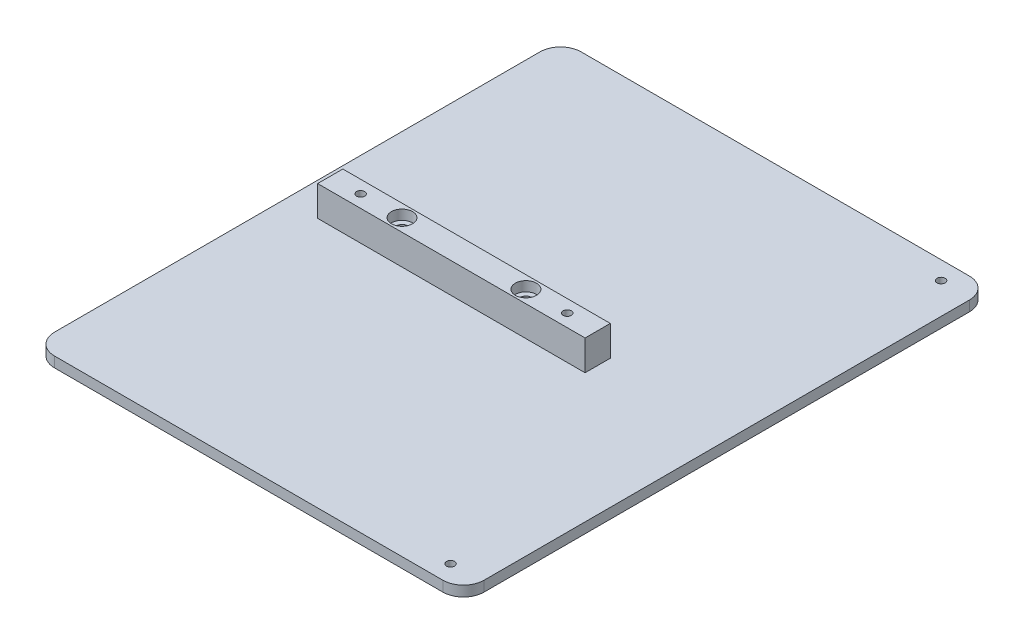
ISO-10303-21;
HEADER;
FILE_DESCRIPTION(('STEP AP214'),'2;1');
FILE_NAME('part.step','',(''),(''),'','','');
FILE_SCHEMA(('AUTOMOTIVE_DESIGN { 1 0 10303 214 1 1 1 1 }'));
ENDSEC;
DATA;
#1=APPLICATION_CONTEXT('core data for automotive mechanical design processes');
#2=APPLICATION_PROTOCOL_DEFINITION('international standard','automotive_design',2000,#1);
#3=PRODUCT_CONTEXT('',#1,'mechanical');
#4=PRODUCT('Part','Part','',(#3));
#5=PRODUCT_RELATED_PRODUCT_CATEGORY('part','',(#4));
#6=PRODUCT_DEFINITION_FORMATION('','',#4);
#7=PRODUCT_DEFINITION_CONTEXT('part definition',#1,'design');
#8=PRODUCT_DEFINITION('design','',#6,#7);
#9=PRODUCT_DEFINITION_SHAPE('','',#8);
#10=(LENGTH_UNIT() NAMED_UNIT(*) SI_UNIT(.MILLI.,.METRE.));
#11=(NAMED_UNIT(*) PLANE_ANGLE_UNIT() SI_UNIT($,.RADIAN.));
#12=(NAMED_UNIT(*) SI_UNIT($,.STERADIAN.) SOLID_ANGLE_UNIT());
#13=UNCERTAINTY_MEASURE_WITH_UNIT(LENGTH_MEASURE(1.E-05),#10,'distance_accuracy_value','');
#14=(GEOMETRIC_REPRESENTATION_CONTEXT(3) GLOBAL_UNCERTAINTY_ASSIGNED_CONTEXT((#13)) GLOBAL_UNIT_ASSIGNED_CONTEXT((#10,
#11,#12)) REPRESENTATION_CONTEXT('',''));
#15=CARTESIAN_POINT('',(0.,0.,0.));
#16=DIRECTION('',(0.,0.,1.));
#17=DIRECTION('',(1.,0.,0.));
#18=AXIS2_PLACEMENT_3D('',#15,#16,#17);
#19=CARTESIAN_POINT('',(0.,3.175,0.));
#20=DIRECTION('',(0.,1.,0.));
#21=DIRECTION('',(0.,0.,1.));
#22=AXIS2_PLACEMENT_3D('',#19,#20,#21);
#23=PLANE('',#22);
#24=CARTESIAN_POINT('',(56.5150000000001,3.175,75.40625));
#25=DIRECTION('',(0.,1.,0.));
#26=DIRECTION('',(0.,0.,1.));
#27=AXIS2_PLACEMENT_3D('',#24,#25,#26);
#28=CIRCLE('',#27,1.25);
#29=CARTESIAN_POINT('',(56.5150000000001,3.175,76.65625));
#30=VERTEX_POINT('',#29);
#31=EDGE_CURVE('E148',#30,#30,#28,.T.);
#32=ORIENTED_EDGE('',*,*,#31,.F.);
#33=EDGE_LOOP('',(#32));
#34=FACE_BOUND('',#33,.T.);
#35=CARTESIAN_POINT('',(56.515,3.175,-75.40625));
#36=DIRECTION('',(0.,1.,0.));
#37=DIRECTION('',(0.,0.,1.));
#38=AXIS2_PLACEMENT_3D('',#35,#36,#37);
#39=CIRCLE('',#38,1.25);
#40=CARTESIAN_POINT('',(56.515,3.175,-74.15625));
#41=VERTEX_POINT('',#40);
#42=EDGE_CURVE('E158',#41,#41,#39,.T.);
#43=ORIENTED_EDGE('',*,*,#42,.F.);
#44=EDGE_LOOP('',(#43));
#45=FACE_BOUND('',#44,.T.);
#46=DIRECTION('',(-1.,0.,0.));
#47=VECTOR('',#46,1.);
#48=CARTESIAN_POINT('',(66.04,3.175,-80.9625));
#49=LINE('',#48,#47);
#50=CARTESIAN_POINT('',(59.69,3.175,-80.9625));
#51=VERTEX_POINT('',#50);
#52=CARTESIAN_POINT('',(-59.69,3.175,-80.9625));
#53=VERTEX_POINT('',#52);
#54=EDGE_CURVE('E174',#51,#53,#49,.T.);
#55=ORIENTED_EDGE('',*,*,#54,.T.);
#56=CARTESIAN_POINT('',(-59.69,3.175,-74.6125));
#57=DIRECTION('',(0.,1.,0.));
#58=DIRECTION('',(0.,0.,1.));
#59=AXIS2_PLACEMENT_3D('',#56,#57,#58);
#60=CIRCLE('',#59,6.35);
#61=CARTESIAN_POINT('',(-66.04,3.175,-74.6125));
#62=VERTEX_POINT('',#61);
#63=EDGE_CURVE('E210',#53,#62,#60,.T.);
#64=ORIENTED_EDGE('',*,*,#63,.T.);
#65=DIRECTION('',(0.,0.,1.));
#66=VECTOR('',#65,1.);
#67=CARTESIAN_POINT('',(-66.04,3.175,80.9625));
#68=LINE('',#67,#66);
#69=CARTESIAN_POINT('',(-66.04,3.175,74.6125));
#70=VERTEX_POINT('',#69);
#71=EDGE_CURVE('E165',#62,#70,#68,.T.);
#72=ORIENTED_EDGE('',*,*,#71,.T.);
#73=CARTESIAN_POINT('',(-59.69,3.175,74.6125));
#74=DIRECTION('',(0.,1.,0.));
#75=DIRECTION('',(0.,0.,1.));
#76=AXIS2_PLACEMENT_3D('',#73,#74,#75);
#77=CIRCLE('',#76,6.35);
#78=CARTESIAN_POINT('',(-59.69,3.175,80.9625));
#79=VERTEX_POINT('',#78);
#80=EDGE_CURVE('E204',#70,#79,#77,.T.);
#81=ORIENTED_EDGE('',*,*,#80,.T.);
#82=DIRECTION('',(1.,0.,0.));
#83=VECTOR('',#82,1.);
#84=CARTESIAN_POINT('',(66.04,3.175,80.9625));
#85=LINE('',#84,#83);
#86=CARTESIAN_POINT('',(59.69,3.175,80.9625));
#87=VERTEX_POINT('',#86);
#88=EDGE_CURVE('E168',#79,#87,#85,.T.);
#89=ORIENTED_EDGE('',*,*,#88,.T.);
#90=CARTESIAN_POINT('',(59.69,3.175,74.6125));
#91=DIRECTION('',(0.,1.,0.));
#92=DIRECTION('',(0.,0.,1.));
#93=AXIS2_PLACEMENT_3D('',#90,#91,#92);
#94=CIRCLE('',#93,6.35);
#95=CARTESIAN_POINT('',(66.04,3.175,74.6125));
#96=VERTEX_POINT('',#95);
#97=EDGE_CURVE('E206',#87,#96,#94,.T.);
#98=ORIENTED_EDGE('',*,*,#97,.T.);
#99=DIRECTION('',(0.,0.,-1.));
#100=VECTOR('',#99,1.);
#101=CARTESIAN_POINT('',(66.04,3.175,80.9625));
#102=LINE('',#101,#100);
#103=CARTESIAN_POINT('',(66.04,3.175,-74.6125));
#104=VERTEX_POINT('',#103);
#105=EDGE_CURVE('E172',#96,#104,#102,.T.);
#106=ORIENTED_EDGE('',*,*,#105,.T.);
#107=CARTESIAN_POINT('',(59.69,3.175,-74.6125));
#108=DIRECTION('',(0.,1.,0.));
#109=DIRECTION('',(0.,0.,1.));
#110=AXIS2_PLACEMENT_3D('',#107,#108,#109);
#111=CIRCLE('',#110,6.35);
#112=EDGE_CURVE('E208',#104,#51,#111,.T.);
#113=ORIENTED_EDGE('',*,*,#112,.T.);
#114=EDGE_LOOP('',(#55,#64,#72,#81,#89,#98,#106,#113));
#115=FACE_BOUND('',#114,.T.);
#116=DIRECTION('',(1.,0.,0.));
#117=VECTOR('',#116,1.);
#118=CARTESIAN_POINT('',(26.343135748156,3.175,3.87349999999999));
#119=LINE('',#118,#117);
#120=CARTESIAN_POINT('',(-55.883335748156,3.175,3.87349999999999));
#121=VERTEX_POINT('',#120);
#122=CARTESIAN_POINT('',(26.343135748156,3.175,3.87349999999999));
#123=VERTEX_POINT('',#122);
#124=EDGE_CURVE('E479',#121,#123,#119,.T.);
#125=ORIENTED_EDGE('',*,*,#124,.F.);
#126=DIRECTION('',(0.,0.,1.));
#127=VECTOR('',#126,1.);
#128=CARTESIAN_POINT('',(-55.883335748156,3.175,3.87349999999999));
#129=LINE('',#128,#127);
#130=CARTESIAN_POINT('',(-55.883335748156,3.175,-3.87350000000002));
#131=VERTEX_POINT('',#130);
#132=EDGE_CURVE('E146',#131,#121,#129,.T.);
#133=ORIENTED_EDGE('',*,*,#132,.F.);
#134=DIRECTION('',(-1.,0.,0.));
#135=VECTOR('',#134,1.);
#136=CARTESIAN_POINT('',(26.343135748156,3.175,-3.87350000000002));
#137=LINE('',#136,#135);
#138=CARTESIAN_POINT('',(26.343135748156,3.175,-3.87350000000002));
#139=VERTEX_POINT('',#138);
#140=EDGE_CURVE('E142',#139,#131,#137,.T.);
#141=ORIENTED_EDGE('',*,*,#140,.F.);
#142=DIRECTION('',(0.,0.,-1.));
#143=VECTOR('',#142,1.);
#144=CARTESIAN_POINT('',(26.343135748156,3.175,3.87349999999999));
#145=LINE('',#144,#143);
#146=EDGE_CURVE('E481',#123,#139,#145,.T.);
#147=ORIENTED_EDGE('',*,*,#146,.F.);
#148=EDGE_LOOP('',(#125,#133,#141,#147));
#149=FACE_BOUND('',#148,.T.);
#150=ADVANCED_FACE('F33',(#34,#45,#115,#149),#23,.T.);
#151=CARTESIAN_POINT('',(-66.04,3.175,80.9625));
#152=DIRECTION('',(1.,0.,0.));
#153=DIRECTION('',(0.,0.,-1.));
#154=AXIS2_PLACEMENT_3D('',#151,#152,#153);
#155=PLANE('',#154);
#156=ORIENTED_EDGE('',*,*,#71,.F.);
#157=DIRECTION('',(0.,-1.,0.));
#158=VECTOR('',#157,1.);
#159=CARTESIAN_POINT('',(-66.04,3.175,-74.6125));
#160=LINE('',#159,#158);
#161=CARTESIAN_POINT('',(-66.04,0.,-74.6125));
#162=VERTEX_POINT('',#161);
#163=EDGE_CURVE('E188',#62,#162,#160,.T.);
#164=ORIENTED_EDGE('',*,*,#163,.T.);
#165=DIRECTION('',(0.,0.,1.));
#166=VECTOR('',#165,1.);
#167=CARTESIAN_POINT('',(-66.04,0.,80.9625));
#168=LINE('',#167,#166);
#169=CARTESIAN_POINT('',(-66.04,0.,74.6125));
#170=VERTEX_POINT('',#169);
#171=EDGE_CURVE('E164',#162,#170,#168,.T.);
#172=ORIENTED_EDGE('',*,*,#171,.T.);
#173=DIRECTION('',(0.,-1.,0.));
#174=VECTOR('',#173,1.);
#175=CARTESIAN_POINT('',(-66.04,3.175,74.6125));
#176=LINE('',#175,#174);
#177=EDGE_CURVE('E177',#170,#70,#176,.F.);
#178=ORIENTED_EDGE('',*,*,#177,.T.);
#179=EDGE_LOOP('',(#156,#164,#172,#178));
#180=FACE_BOUND('',#179,.T.);
#181=ADVANCED_FACE('F250',(#180),#155,.F.);
#182=CARTESIAN_POINT('',(66.04,3.175,80.9625));
#183=DIRECTION('',(0.,0.,-1.));
#184=DIRECTION('',(-1.,0.,0.));
#185=AXIS2_PLACEMENT_3D('',#182,#183,#184);
#186=PLANE('',#185);
#187=DIRECTION('',(1.,0.,0.));
#188=VECTOR('',#187,1.);
#189=CARTESIAN_POINT('',(66.04,0.,80.9625));
#190=LINE('',#189,#188);
#191=CARTESIAN_POINT('',(-59.69,0.,80.9625));
#192=VERTEX_POINT('',#191);
#193=CARTESIAN_POINT('',(59.69,0.,80.9625));
#194=VERTEX_POINT('',#193);
#195=EDGE_CURVE('E180',#192,#194,#190,.T.);
#196=ORIENTED_EDGE('',*,*,#195,.T.);
#197=DIRECTION('',(0.,-1.,0.));
#198=VECTOR('',#197,1.);
#199=CARTESIAN_POINT('',(59.69,3.175,80.9625));
#200=LINE('',#199,#198);
#201=EDGE_CURVE('E11',#194,#87,#200,.F.);
#202=ORIENTED_EDGE('',*,*,#201,.T.);
#203=ORIENTED_EDGE('',*,*,#88,.F.);
#204=DIRECTION('',(0.,-1.,0.));
#205=VECTOR('',#204,1.);
#206=CARTESIAN_POINT('',(-59.69,3.175,80.9625));
#207=LINE('',#206,#205);
#208=EDGE_CURVE('E41',#79,#192,#207,.T.);
#209=ORIENTED_EDGE('',*,*,#208,.T.);
#210=EDGE_LOOP('',(#196,#202,#203,#209));
#211=FACE_BOUND('',#210,.T.);
#212=ADVANCED_FACE('F220',(#211),#186,.F.);
#213=CARTESIAN_POINT('',(66.04,3.175,80.9625));
#214=DIRECTION('',(-1.,0.,0.));
#215=DIRECTION('',(0.,0.,1.));
#216=AXIS2_PLACEMENT_3D('',#213,#214,#215);
#217=PLANE('',#216);
#218=DIRECTION('',(0.,0.,-1.));
#219=VECTOR('',#218,1.);
#220=CARTESIAN_POINT('',(66.04,0.,80.9625));
#221=LINE('',#220,#219);
#222=CARTESIAN_POINT('',(66.04,0.,74.6125));
#223=VERTEX_POINT('',#222);
#224=CARTESIAN_POINT('',(66.04,0.,-74.6125));
#225=VERTEX_POINT('',#224);
#226=EDGE_CURVE('E183',#223,#225,#221,.T.);
#227=ORIENTED_EDGE('',*,*,#226,.T.);
#228=DIRECTION('',(0.,-1.,0.));
#229=VECTOR('',#228,1.);
#230=CARTESIAN_POINT('',(66.04,3.175,-74.6125));
#231=LINE('',#230,#229);
#232=EDGE_CURVE('E56',#225,#104,#231,.F.);
#233=ORIENTED_EDGE('',*,*,#232,.T.);
#234=ORIENTED_EDGE('',*,*,#105,.F.);
#235=DIRECTION('',(0.,-1.,0.));
#236=VECTOR('',#235,1.);
#237=CARTESIAN_POINT('',(66.04,3.175,74.6125));
#238=LINE('',#237,#236);
#239=EDGE_CURVE('E212',#96,#223,#238,.T.);
#240=ORIENTED_EDGE('',*,*,#239,.T.);
#241=EDGE_LOOP('',(#227,#233,#234,#240));
#242=FACE_BOUND('',#241,.T.);
#243=ADVANCED_FACE('F232',(#242),#217,.F.);
#244=CARTESIAN_POINT('',(66.04,3.175,-80.9625));
#245=DIRECTION('',(0.,0.,1.));
#246=DIRECTION('',(1.,0.,0.));
#247=AXIS2_PLACEMENT_3D('',#244,#245,#246);
#248=PLANE('',#247);
#249=DIRECTION('',(-1.,0.,0.));
#250=VECTOR('',#249,1.);
#251=CARTESIAN_POINT('',(66.04,0.,-80.9625));
#252=LINE('',#251,#250);
#253=CARTESIAN_POINT('',(59.69,0.,-80.9625));
#254=VERTEX_POINT('',#253);
#255=CARTESIAN_POINT('',(-59.69,0.,-80.9625));
#256=VERTEX_POINT('',#255);
#257=EDGE_CURVE('E169',#254,#256,#252,.T.);
#258=ORIENTED_EDGE('',*,*,#257,.T.);
#259=DIRECTION('',(0.,-1.,0.));
#260=VECTOR('',#259,1.);
#261=CARTESIAN_POINT('',(-59.69,3.175,-80.9625));
#262=LINE('',#261,#260);
#263=EDGE_CURVE('E202',#256,#53,#262,.F.);
#264=ORIENTED_EDGE('',*,*,#263,.T.);
#265=ORIENTED_EDGE('',*,*,#54,.F.);
#266=DIRECTION('',(0.,-1.,0.));
#267=VECTOR('',#266,1.);
#268=CARTESIAN_POINT('',(59.69,3.175,-80.9625));
#269=LINE('',#268,#267);
#270=EDGE_CURVE('E199',#51,#254,#269,.T.);
#271=ORIENTED_EDGE('',*,*,#270,.T.);
#272=EDGE_LOOP('',(#258,#264,#265,#271));
#273=FACE_BOUND('',#272,.T.);
#274=ADVANCED_FACE('F242',(#273),#248,.F.);
#275=CARTESIAN_POINT('',(0.,0.,0.));
#276=DIRECTION('',(0.,1.,0.));
#277=DIRECTION('',(0.,0.,1.));
#278=AXIS2_PLACEMENT_3D('',#275,#276,#277);
#279=PLANE('',#278);
#280=CARTESIAN_POINT('',(-33.8201,0.,0.));
#281=DIRECTION('',(0.,1.,0.));
#282=DIRECTION('',(0.,0.,1.));
#283=AXIS2_PLACEMENT_3D('',#280,#281,#282);
#284=CIRCLE('',#283,1.69999999999999);
#285=CARTESIAN_POINT('',(-33.8201,0.,1.69999999999998));
#286=VERTEX_POINT('',#285);
#287=EDGE_CURVE('E448',#286,#286,#284,.T.);
#288=ORIENTED_EDGE('',*,*,#287,.T.);
#289=EDGE_LOOP('',(#288));
#290=FACE_BOUND('',#289,.T.);
#291=CARTESIAN_POINT('',(4.27990000000003,0.,0.));
#292=DIRECTION('',(0.,1.,0.));
#293=DIRECTION('',(0.,0.,1.));
#294=AXIS2_PLACEMENT_3D('',#291,#292,#293);
#295=CIRCLE('',#294,1.7);
#296=CARTESIAN_POINT('',(4.27990000000003,0.,1.69999999999998));
#297=VERTEX_POINT('',#296);
#298=EDGE_CURVE('E460',#297,#297,#295,.T.);
#299=ORIENTED_EDGE('',*,*,#298,.T.);
#300=EDGE_LOOP('',(#299));
#301=FACE_BOUND('',#300,.T.);
#302=CARTESIAN_POINT('',(-46.5201,0.,0.));
#303=DIRECTION('',(0.,1.,0.));
#304=DIRECTION('',(0.,0.,1.));
#305=AXIS2_PLACEMENT_3D('',#302,#303,#304);
#306=CIRCLE('',#305,1.24999999999999);
#307=CARTESIAN_POINT('',(-46.5201,0.,1.24999999999997));
#308=VERTEX_POINT('',#307);
#309=EDGE_CURVE('E466',#308,#308,#306,.T.);
#310=ORIENTED_EDGE('',*,*,#309,.T.);
#311=EDGE_LOOP('',(#310));
#312=FACE_BOUND('',#311,.T.);
#313=CARTESIAN_POINT('',(16.9799,0.,0.));
#314=DIRECTION('',(0.,1.,0.));
#315=DIRECTION('',(0.,0.,1.));
#316=AXIS2_PLACEMENT_3D('',#313,#314,#315);
#317=CIRCLE('',#316,1.25);
#318=CARTESIAN_POINT('',(16.9799,0.,1.24999999999996));
#319=VERTEX_POINT('',#318);
#320=EDGE_CURVE('E472',#319,#319,#317,.T.);
#321=ORIENTED_EDGE('',*,*,#320,.T.);
#322=EDGE_LOOP('',(#321));
#323=FACE_BOUND('',#322,.T.);
#324=CARTESIAN_POINT('',(56.5150000000001,0.,75.40625));
#325=DIRECTION('',(0.,1.,0.));
#326=DIRECTION('',(0.,0.,1.));
#327=AXIS2_PLACEMENT_3D('',#324,#325,#326);
#328=CIRCLE('',#327,1.25);
#329=CARTESIAN_POINT('',(56.5150000000001,0.,76.65625));
#330=VERTEX_POINT('',#329);
#331=EDGE_CURVE('E151',#330,#330,#328,.T.);
#332=ORIENTED_EDGE('',*,*,#331,.T.);
#333=EDGE_LOOP('',(#332));
#334=FACE_BOUND('',#333,.T.);
#335=CARTESIAN_POINT('',(56.515,0.,-75.40625));
#336=DIRECTION('',(0.,1.,0.));
#337=DIRECTION('',(0.,0.,1.));
#338=AXIS2_PLACEMENT_3D('',#335,#336,#337);
#339=CIRCLE('',#338,1.25);
#340=CARTESIAN_POINT('',(56.515,0.,-74.15625));
#341=VERTEX_POINT('',#340);
#342=EDGE_CURVE('E161',#341,#341,#339,.T.);
#343=ORIENTED_EDGE('',*,*,#342,.T.);
#344=EDGE_LOOP('',(#343));
#345=FACE_BOUND('',#344,.T.);
#346=ORIENTED_EDGE('',*,*,#171,.F.);
#347=CARTESIAN_POINT('',(-59.69,0.,-74.6125));
#348=DIRECTION('',(0.,1.,0.));
#349=DIRECTION('',(0.,0.,1.));
#350=AXIS2_PLACEMENT_3D('',#347,#348,#349);
#351=CIRCLE('',#350,6.35);
#352=EDGE_CURVE('E197',#162,#256,#351,.F.);
#353=ORIENTED_EDGE('',*,*,#352,.T.);
#354=ORIENTED_EDGE('',*,*,#257,.F.);
#355=CARTESIAN_POINT('',(59.69,0.,-74.6125));
#356=DIRECTION('',(0.,1.,0.));
#357=DIRECTION('',(0.,0.,1.));
#358=AXIS2_PLACEMENT_3D('',#355,#356,#357);
#359=CIRCLE('',#358,6.35);
#360=EDGE_CURVE('E195',#254,#225,#359,.F.);
#361=ORIENTED_EDGE('',*,*,#360,.T.);
#362=ORIENTED_EDGE('',*,*,#226,.F.);
#363=CARTESIAN_POINT('',(59.69,0.,74.6125));
#364=DIRECTION('',(0.,1.,0.));
#365=DIRECTION('',(0.,0.,1.));
#366=AXIS2_PLACEMENT_3D('',#363,#364,#365);
#367=CIRCLE('',#366,6.35);
#368=EDGE_CURVE('E193',#223,#194,#367,.F.);
#369=ORIENTED_EDGE('',*,*,#368,.T.);
#370=ORIENTED_EDGE('',*,*,#195,.F.);
#371=CARTESIAN_POINT('',(-59.69,0.,74.6125));
#372=DIRECTION('',(0.,1.,0.));
#373=DIRECTION('',(0.,0.,1.));
#374=AXIS2_PLACEMENT_3D('',#371,#372,#373);
#375=CIRCLE('',#374,6.35);
#376=EDGE_CURVE('E191',#192,#170,#375,.F.);
#377=ORIENTED_EDGE('',*,*,#376,.T.);
#378=EDGE_LOOP('',(#346,#353,#354,#361,#362,#369,#370,#377));
#379=FACE_BOUND('',#378,.T.);
#380=ADVANCED_FACE('F226',(#290,#301,#312,#323,#334,#345,#379),#279,.F.);
#381=CARTESIAN_POINT('',(-59.69,3.175,-74.6125));
#382=DIRECTION('',(0.,-1.,0.));
#383=DIRECTION('',(0.,0.,-1.));
#384=AXIS2_PLACEMENT_3D('',#381,#382,#383);
#385=CYLINDRICAL_SURFACE('',#384,6.35);
#386=ORIENTED_EDGE('',*,*,#63,.F.);
#387=ORIENTED_EDGE('',*,*,#263,.F.);
#388=ORIENTED_EDGE('',*,*,#352,.F.);
#389=ORIENTED_EDGE('',*,*,#163,.F.);
#390=EDGE_LOOP('',(#386,#387,#388,#389));
#391=FACE_BOUND('',#390,.T.);
#392=ADVANCED_FACE('F247',(#391),#385,.T.);
#393=CARTESIAN_POINT('',(59.69,3.175,-74.6125));
#394=DIRECTION('',(0.,-1.,0.));
#395=DIRECTION('',(0.,0.,-1.));
#396=AXIS2_PLACEMENT_3D('',#393,#394,#395);
#397=CYLINDRICAL_SURFACE('',#396,6.35);
#398=ORIENTED_EDGE('',*,*,#112,.F.);
#399=ORIENTED_EDGE('',*,*,#232,.F.);
#400=ORIENTED_EDGE('',*,*,#360,.F.);
#401=ORIENTED_EDGE('',*,*,#270,.F.);
#402=EDGE_LOOP('',(#398,#399,#400,#401));
#403=FACE_BOUND('',#402,.T.);
#404=ADVANCED_FACE('F239',(#403),#397,.T.);
#405=CARTESIAN_POINT('',(59.69,3.175,74.6125));
#406=DIRECTION('',(0.,-1.,0.));
#407=DIRECTION('',(0.,0.,-1.));
#408=AXIS2_PLACEMENT_3D('',#405,#406,#407);
#409=CYLINDRICAL_SURFACE('',#408,6.35);
#410=ORIENTED_EDGE('',*,*,#97,.F.);
#411=ORIENTED_EDGE('',*,*,#201,.F.);
#412=ORIENTED_EDGE('',*,*,#368,.F.);
#413=ORIENTED_EDGE('',*,*,#239,.F.);
#414=EDGE_LOOP('',(#410,#411,#412,#413));
#415=FACE_BOUND('',#414,.T.);
#416=ADVANCED_FACE('F231',(#415),#409,.T.);
#417=CARTESIAN_POINT('',(-59.69,3.175,74.6125));
#418=DIRECTION('',(0.,-1.,0.));
#419=DIRECTION('',(0.,0.,-1.));
#420=AXIS2_PLACEMENT_3D('',#417,#418,#419);
#421=CYLINDRICAL_SURFACE('',#420,6.35);
#422=ORIENTED_EDGE('',*,*,#80,.F.);
#423=ORIENTED_EDGE('',*,*,#177,.F.);
#424=ORIENTED_EDGE('',*,*,#376,.F.);
#425=ORIENTED_EDGE('',*,*,#208,.F.);
#426=EDGE_LOOP('',(#422,#423,#424,#425));
#427=FACE_BOUND('',#426,.T.);
#428=ADVANCED_FACE('F35',(#427),#421,.T.);
#429=CARTESIAN_POINT('',(56.515,3.175,-75.40625));
#430=DIRECTION('',(0.,1.,0.));
#431=DIRECTION('',(0.,0.,1.));
#432=AXIS2_PLACEMENT_3D('',#429,#430,#431);
#433=CYLINDRICAL_SURFACE('',#432,1.25);
#434=ORIENTED_EDGE('',*,*,#342,.F.);
#435=EDGE_LOOP('',(#434));
#436=FACE_BOUND('',#435,.T.);
#437=ORIENTED_EDGE('',*,*,#42,.T.);
#438=EDGE_LOOP('',(#437));
#439=FACE_BOUND('',#438,.T.);
#440=ADVANCED_FACE('F253',(#436,#439),#433,.F.);
#441=CARTESIAN_POINT('',(56.5150000000001,3.175,75.40625));
#442=DIRECTION('',(0.,1.,0.));
#443=DIRECTION('',(0.,0.,1.));
#444=AXIS2_PLACEMENT_3D('',#441,#442,#443);
#445=CYLINDRICAL_SURFACE('',#444,1.25);
#446=ORIENTED_EDGE('',*,*,#331,.F.);
#447=EDGE_LOOP('',(#446));
#448=FACE_BOUND('',#447,.T.);
#449=ORIENTED_EDGE('',*,*,#31,.T.);
#450=EDGE_LOOP('',(#449));
#451=FACE_BOUND('',#450,.T.);
#452=ADVANCED_FACE('F258',(#448,#451),#445,.F.);
#453=CARTESIAN_POINT('',(-55.883335748156,12.446,3.87349999999999));
#454=DIRECTION('',(1.,0.,0.));
#455=DIRECTION('',(0.,0.,-1.));
#456=AXIS2_PLACEMENT_3D('',#453,#454,#455);
#457=PLANE('',#456);
#458=ORIENTED_EDGE('',*,*,#132,.T.);
#459=DIRECTION('',(0.,-1.,0.));
#460=VECTOR('',#459,1.);
#461=CARTESIAN_POINT('',(-55.883335748156,12.446,3.87349999999999));
#462=LINE('',#461,#460);
#463=CARTESIAN_POINT('',(-55.883335748156,12.446,3.87349999999999));
#464=VERTEX_POINT('',#463);
#465=EDGE_CURVE('E127',#464,#121,#462,.T.);
#466=ORIENTED_EDGE('',*,*,#465,.F.);
#467=DIRECTION('',(0.,0.,1.));
#468=VECTOR('',#467,1.);
#469=CARTESIAN_POINT('',(-55.883335748156,12.446,3.87349999999999));
#470=LINE('',#469,#468);
#471=CARTESIAN_POINT('',(-55.883335748156,12.446,-3.87350000000002));
#472=VERTEX_POINT('',#471);
#473=EDGE_CURVE('E134',#472,#464,#470,.T.);
#474=ORIENTED_EDGE('',*,*,#473,.F.);
#475=DIRECTION('',(0.,-1.,0.));
#476=VECTOR('',#475,1.);
#477=CARTESIAN_POINT('',(-55.883335748156,12.446,-3.87350000000002));
#478=LINE('',#477,#476);
#479=EDGE_CURVE('E477',#472,#131,#478,.T.);
#480=ORIENTED_EDGE('',*,*,#479,.T.);
#481=EDGE_LOOP('',(#458,#466,#474,#480));
#482=FACE_BOUND('',#481,.T.);
#483=ADVANCED_FACE('F144',(#482),#457,.F.);
#484=CARTESIAN_POINT('',(26.343135748156,12.446,3.87349999999999));
#485=DIRECTION('',(0.,0.,-1.));
#486=DIRECTION('',(-1.,0.,0.));
#487=AXIS2_PLACEMENT_3D('',#484,#485,#486);
#488=PLANE('',#487);
#489=ORIENTED_EDGE('',*,*,#124,.T.);
#490=DIRECTION('',(0.,-1.,0.));
#491=VECTOR('',#490,1.);
#492=CARTESIAN_POINT('',(26.343135748156,12.446,3.87349999999999));
#493=LINE('',#492,#491);
#494=CARTESIAN_POINT('',(26.343135748156,12.446,3.87349999999999));
#495=VERTEX_POINT('',#494);
#496=EDGE_CURVE('E130',#495,#123,#493,.T.);
#497=ORIENTED_EDGE('',*,*,#496,.F.);
#498=DIRECTION('',(1.,0.,0.));
#499=VECTOR('',#498,1.);
#500=CARTESIAN_POINT('',(26.343135748156,12.446,3.87349999999999));
#501=LINE('',#500,#499);
#502=EDGE_CURVE('E123',#464,#495,#501,.T.);
#503=ORIENTED_EDGE('',*,*,#502,.F.);
#504=ORIENTED_EDGE('',*,*,#465,.T.);
#505=EDGE_LOOP('',(#489,#497,#503,#504));
#506=FACE_BOUND('',#505,.T.);
#507=ADVANCED_FACE('F125',(#506),#488,.F.);
#508=CARTESIAN_POINT('',(26.343135748156,12.446,3.87349999999999));
#509=DIRECTION('',(-1.,0.,0.));
#510=DIRECTION('',(0.,0.,1.));
#511=AXIS2_PLACEMENT_3D('',#508,#509,#510);
#512=PLANE('',#511);
#513=ORIENTED_EDGE('',*,*,#146,.T.);
#514=DIRECTION('',(0.,-1.,0.));
#515=VECTOR('',#514,1.);
#516=CARTESIAN_POINT('',(26.343135748156,12.446,-3.87350000000002));
#517=LINE('',#516,#515);
#518=CARTESIAN_POINT('',(26.343135748156,12.446,-3.87350000000002));
#519=VERTEX_POINT('',#518);
#520=EDGE_CURVE('E48',#519,#139,#517,.T.);
#521=ORIENTED_EDGE('',*,*,#520,.F.);
#522=DIRECTION('',(0.,0.,-1.));
#523=VECTOR('',#522,1.);
#524=CARTESIAN_POINT('',(26.343135748156,12.446,3.87349999999999));
#525=LINE('',#524,#523);
#526=EDGE_CURVE('E133',#495,#519,#525,.T.);
#527=ORIENTED_EDGE('',*,*,#526,.F.);
#528=ORIENTED_EDGE('',*,*,#496,.T.);
#529=EDGE_LOOP('',(#513,#521,#527,#528));
#530=FACE_BOUND('',#529,.T.);
#531=ADVANCED_FACE('F329',(#530),#512,.F.);
#532=CARTESIAN_POINT('',(26.343135748156,12.446,-3.87350000000002));
#533=DIRECTION('',(0.,0.,1.));
#534=DIRECTION('',(1.,0.,0.));
#535=AXIS2_PLACEMENT_3D('',#532,#533,#534);
#536=PLANE('',#535);
#537=ORIENTED_EDGE('',*,*,#140,.T.);
#538=ORIENTED_EDGE('',*,*,#479,.F.);
#539=DIRECTION('',(-1.,0.,0.));
#540=VECTOR('',#539,1.);
#541=CARTESIAN_POINT('',(26.343135748156,12.446,-3.87350000000002));
#542=LINE('',#541,#540);
#543=EDGE_CURVE('E138',#519,#472,#542,.T.);
#544=ORIENTED_EDGE('',*,*,#543,.F.);
#545=ORIENTED_EDGE('',*,*,#520,.T.);
#546=EDGE_LOOP('',(#537,#538,#544,#545));
#547=FACE_BOUND('',#546,.T.);
#548=ADVANCED_FACE('F336',(#547),#536,.F.);
#549=CARTESIAN_POINT('',(0.,12.446,0.));
#550=DIRECTION('',(0.,1.,0.));
#551=DIRECTION('',(0.,0.,1.));
#552=AXIS2_PLACEMENT_3D('',#549,#550,#551);
#553=PLANE('',#552);
#554=CARTESIAN_POINT('',(-33.8201,12.446,0.));
#555=DIRECTION('',(0.,1.,0.));
#556=DIRECTION('',(0.,0.,1.));
#557=AXIS2_PLACEMENT_3D('',#554,#555,#556);
#558=CIRCLE('',#557,3.25);
#559=CARTESIAN_POINT('',(-33.8201,12.446,3.24999999999998));
#560=VERTEX_POINT('',#559);
#561=EDGE_CURVE('E441',#560,#560,#558,.T.);
#562=ORIENTED_EDGE('',*,*,#561,.F.);
#563=EDGE_LOOP('',(#562));
#564=FACE_BOUND('',#563,.T.);
#565=CARTESIAN_POINT('',(4.27990000000003,12.446,0.));
#566=DIRECTION('',(0.,1.,0.));
#567=DIRECTION('',(0.,0.,1.));
#568=AXIS2_PLACEMENT_3D('',#565,#566,#567);
#569=CIRCLE('',#568,3.25);
#570=CARTESIAN_POINT('',(4.27990000000003,12.446,3.24999999999998));
#571=VERTEX_POINT('',#570);
#572=EDGE_CURVE('E451',#571,#571,#569,.T.);
#573=ORIENTED_EDGE('',*,*,#572,.F.);
#574=EDGE_LOOP('',(#573));
#575=FACE_BOUND('',#574,.T.);
#576=CARTESIAN_POINT('',(-46.5201,12.446,0.));
#577=DIRECTION('',(0.,1.,0.));
#578=DIRECTION('',(0.,0.,1.));
#579=AXIS2_PLACEMENT_3D('',#576,#577,#578);
#580=CIRCLE('',#579,1.25);
#581=CARTESIAN_POINT('',(-46.5201,12.446,1.24999999999998));
#582=VERTEX_POINT('',#581);
#583=EDGE_CURVE('E463',#582,#582,#580,.T.);
#584=ORIENTED_EDGE('',*,*,#583,.F.);
#585=EDGE_LOOP('',(#584));
#586=FACE_BOUND('',#585,.T.);
#587=CARTESIAN_POINT('',(16.9799,12.446,0.));
#588=DIRECTION('',(0.,1.,0.));
#589=DIRECTION('',(0.,0.,1.));
#590=AXIS2_PLACEMENT_3D('',#587,#588,#589);
#591=CIRCLE('',#590,1.25);
#592=CARTESIAN_POINT('',(16.9799,12.446,1.24999999999996));
#593=VERTEX_POINT('',#592);
#594=EDGE_CURVE('E469',#593,#593,#591,.T.);
#595=ORIENTED_EDGE('',*,*,#594,.F.);
#596=EDGE_LOOP('',(#595));
#597=FACE_BOUND('',#596,.T.);
#598=ORIENTED_EDGE('',*,*,#473,.T.);
#599=ORIENTED_EDGE('',*,*,#502,.T.);
#600=ORIENTED_EDGE('',*,*,#526,.T.);
#601=ORIENTED_EDGE('',*,*,#543,.T.);
#602=EDGE_LOOP('',(#598,#599,#600,#601));
#603=FACE_BOUND('',#602,.T.);
#604=ADVANCED_FACE('F137',(#564,#575,#586,#597,#603),#553,.T.);
#605=CARTESIAN_POINT('',(16.9799,12.446,0.));
#606=DIRECTION('',(0.,1.,0.));
#607=DIRECTION('',(0.,0.,1.));
#608=AXIS2_PLACEMENT_3D('',#605,#606,#607);
#609=CYLINDRICAL_SURFACE('',#608,1.25);
#610=ORIENTED_EDGE('',*,*,#320,.F.);
#611=EDGE_LOOP('',(#610));
#612=FACE_BOUND('',#611,.T.);
#613=ORIENTED_EDGE('',*,*,#594,.T.);
#614=EDGE_LOOP('',(#613));
#615=FACE_BOUND('',#614,.T.);
#616=ADVANCED_FACE('F352',(#612,#615),#609,.F.);
#617=CARTESIAN_POINT('',(-46.5201,12.446,0.));
#618=DIRECTION('',(0.,1.,0.));
#619=DIRECTION('',(0.,0.,1.));
#620=AXIS2_PLACEMENT_3D('',#617,#618,#619);
#621=CYLINDRICAL_SURFACE('',#620,1.25);
#622=ORIENTED_EDGE('',*,*,#309,.F.);
#623=EDGE_LOOP('',(#622));
#624=FACE_BOUND('',#623,.T.);
#625=ORIENTED_EDGE('',*,*,#583,.T.);
#626=EDGE_LOOP('',(#625));
#627=FACE_BOUND('',#626,.T.);
#628=ADVANCED_FACE('F362',(#624,#627),#621,.F.);
#629=CARTESIAN_POINT('',(4.27990000000003,12.446,0.));
#630=DIRECTION('',(0.,1.,0.));
#631=DIRECTION('',(0.,0.,1.));
#632=AXIS2_PLACEMENT_3D('',#629,#630,#631);
#633=CYLINDRICAL_SURFACE('',#632,1.7);
#634=ORIENTED_EDGE('',*,*,#298,.F.);
#635=EDGE_LOOP('',(#634));
#636=FACE_BOUND('',#635,.T.);
#637=CARTESIAN_POINT('',(4.27990000000003,9.446,0.));
#638=DIRECTION('',(0.,1.,0.));
#639=DIRECTION('',(0.,0.,1.));
#640=AXIS2_PLACEMENT_3D('',#637,#638,#639);
#641=CIRCLE('',#640,1.7);
#642=CARTESIAN_POINT('',(4.27990000000003,9.446,1.69999999999998));
#643=VERTEX_POINT('',#642);
#644=EDGE_CURVE('E457',#643,#643,#641,.T.);
#645=ORIENTED_EDGE('',*,*,#644,.T.);
#646=EDGE_LOOP('',(#645));
#647=FACE_BOUND('',#646,.T.);
#648=ADVANCED_FACE('F369',(#636,#647),#633,.F.);
#649=CARTESIAN_POINT('',(5.97990000000003,9.446,0.));
#650=DIRECTION('',(0.,-1.,0.));
#651=DIRECTION('',(0.,0.,-1.));
#652=AXIS2_PLACEMENT_3D('',#649,#650,#651);
#653=PLANE('',#652);
#654=ORIENTED_EDGE('',*,*,#644,.F.);
#655=EDGE_LOOP('',(#654));
#656=FACE_BOUND('',#655,.T.);
#657=CARTESIAN_POINT('',(4.27990000000003,9.446,0.));
#658=DIRECTION('',(0.,1.,0.));
#659=DIRECTION('',(0.,0.,1.));
#660=AXIS2_PLACEMENT_3D('',#657,#658,#659);
#661=CIRCLE('',#660,3.25);
#662=CARTESIAN_POINT('',(4.27990000000003,9.446,3.24999999999998));
#663=VERTEX_POINT('',#662);
#664=EDGE_CURVE('E454',#663,#663,#661,.T.);
#665=ORIENTED_EDGE('',*,*,#664,.T.);
#666=EDGE_LOOP('',(#665));
#667=FACE_BOUND('',#666,.T.);
#668=ADVANCED_FACE('F376',(#656,#667),#653,.F.);
#669=CARTESIAN_POINT('',(4.27990000000003,12.446,0.));
#670=DIRECTION('',(0.,1.,0.));
#671=DIRECTION('',(0.,0.,1.));
#672=AXIS2_PLACEMENT_3D('',#669,#670,#671);
#673=CYLINDRICAL_SURFACE('',#672,3.25);
#674=ORIENTED_EDGE('',*,*,#664,.F.);
#675=EDGE_LOOP('',(#674));
#676=FACE_BOUND('',#675,.T.);
#677=ORIENTED_EDGE('',*,*,#572,.T.);
#678=EDGE_LOOP('',(#677));
#679=FACE_BOUND('',#678,.T.);
#680=ADVANCED_FACE('F384',(#676,#679),#673,.F.);
#681=CARTESIAN_POINT('',(-33.8201,12.446,0.));
#682=DIRECTION('',(0.,1.,0.));
#683=DIRECTION('',(0.,0.,1.));
#684=AXIS2_PLACEMENT_3D('',#681,#682,#683);
#685=CYLINDRICAL_SURFACE('',#684,1.7);
#686=ORIENTED_EDGE('',*,*,#287,.F.);
#687=EDGE_LOOP('',(#686));
#688=FACE_BOUND('',#687,.T.);
#689=CARTESIAN_POINT('',(-33.8201,9.446,0.));
#690=DIRECTION('',(0.,1.,0.));
#691=DIRECTION('',(0.,0.,1.));
#692=AXIS2_PLACEMENT_3D('',#689,#690,#691);
#693=CIRCLE('',#692,1.7);
#694=CARTESIAN_POINT('',(-33.8201,9.446,1.69999999999998));
#695=VERTEX_POINT('',#694);
#696=EDGE_CURVE('E443',#695,#695,#693,.T.);
#697=ORIENTED_EDGE('',*,*,#696,.T.);
#698=EDGE_LOOP('',(#697));
#699=FACE_BOUND('',#698,.T.);
#700=ADVANCED_FACE('F392',(#688,#699),#685,.F.);
#701=CARTESIAN_POINT('',(-32.1201,9.446,0.));
#702=DIRECTION('',(0.,-1.,0.));
#703=DIRECTION('',(0.,0.,-1.));
#704=AXIS2_PLACEMENT_3D('',#701,#702,#703);
#705=PLANE('',#704);
#706=ORIENTED_EDGE('',*,*,#696,.F.);
#707=EDGE_LOOP('',(#706));
#708=FACE_BOUND('',#707,.T.);
#709=CARTESIAN_POINT('',(-33.8201,9.446,0.));
#710=DIRECTION('',(0.,1.,0.));
#711=DIRECTION('',(0.,0.,1.));
#712=AXIS2_PLACEMENT_3D('',#709,#710,#711);
#713=CIRCLE('',#712,3.25);
#714=CARTESIAN_POINT('',(-33.8201,9.446,3.24999999999998));
#715=VERTEX_POINT('',#714);
#716=EDGE_CURVE('E438',#715,#715,#713,.T.);
#717=ORIENTED_EDGE('',*,*,#716,.T.);
#718=EDGE_LOOP('',(#717));
#719=FACE_BOUND('',#718,.T.);
#720=ADVANCED_FACE('F400',(#708,#719),#705,.F.);
#721=CARTESIAN_POINT('',(-33.8201,12.446,0.));
#722=DIRECTION('',(0.,1.,0.));
#723=DIRECTION('',(0.,0.,1.));
#724=AXIS2_PLACEMENT_3D('',#721,#722,#723);
#725=CYLINDRICAL_SURFACE('',#724,3.25);
#726=ORIENTED_EDGE('',*,*,#716,.F.);
#727=EDGE_LOOP('',(#726));
#728=FACE_BOUND('',#727,.T.);
#729=ORIENTED_EDGE('',*,*,#561,.T.);
#730=EDGE_LOOP('',(#729));
#731=FACE_BOUND('',#730,.T.);
#732=ADVANCED_FACE('F408',(#728,#731),#725,.F.);
#733=CLOSED_SHELL('',(#150,#181,#212,#243,#274,#380,#392,#404,#416,#428,#440,#452,#483,#507,
#531,#548,#604,#616,#628,#648,#668,#680,#700,#720,#732));
#734=MANIFOLD_SOLID_BREP('B2',#733);
#735=ADVANCED_BREP_SHAPE_REPRESENTATION('',(#18,#734),#14);
#736=SHAPE_DEFINITION_REPRESENTATION(#9,#735);
ENDSEC;
END-ISO-10303-21;
